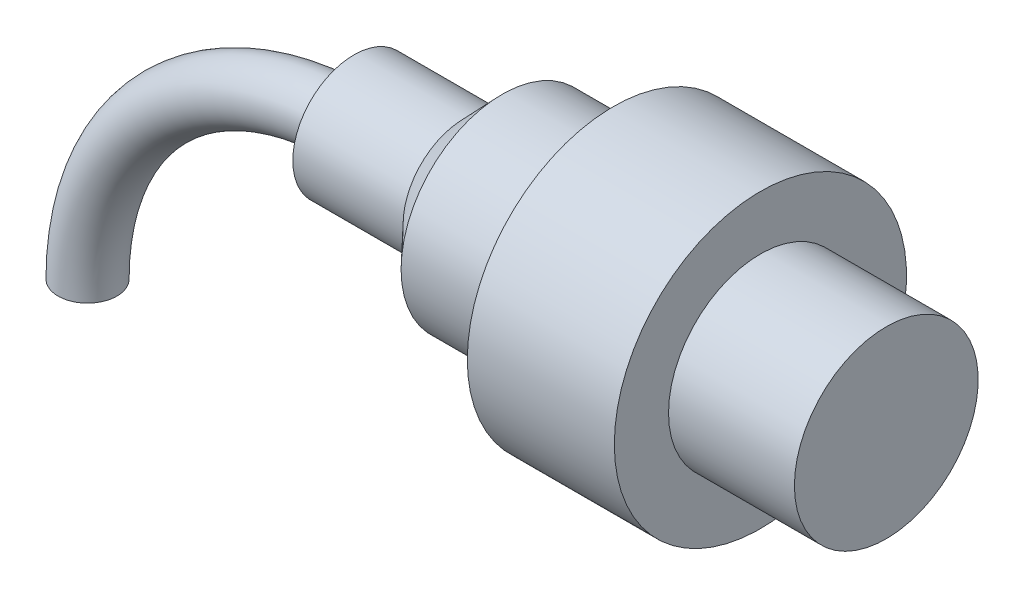
ISO-10303-21;
HEADER;
FILE_DESCRIPTION(('STEP AP214'),'2;1');
FILE_NAME('part.step','',(''),(''),'','','');
FILE_SCHEMA(('AUTOMOTIVE_DESIGN { 1 0 10303 214 1 1 1 1 }'));
ENDSEC;
DATA;
#1=APPLICATION_CONTEXT('core data for automotive mechanical design processes');
#2=APPLICATION_PROTOCOL_DEFINITION('international standard','automotive_design',2000,#1);
#3=PRODUCT_CONTEXT('',#1,'mechanical');
#4=PRODUCT('Part','Part','',(#3));
#5=PRODUCT_RELATED_PRODUCT_CATEGORY('part','',(#4));
#6=PRODUCT_DEFINITION_FORMATION('','',#4);
#7=PRODUCT_DEFINITION_CONTEXT('part definition',#1,'design');
#8=PRODUCT_DEFINITION('design','',#6,#7);
#9=PRODUCT_DEFINITION_SHAPE('','',#8);
#10=(LENGTH_UNIT() NAMED_UNIT(*) SI_UNIT(.MILLI.,.METRE.));
#11=(NAMED_UNIT(*) PLANE_ANGLE_UNIT() SI_UNIT($,.RADIAN.));
#12=(NAMED_UNIT(*) SI_UNIT($,.STERADIAN.) SOLID_ANGLE_UNIT());
#13=UNCERTAINTY_MEASURE_WITH_UNIT(LENGTH_MEASURE(1.E-05),#10,'distance_accuracy_value','');
#14=(GEOMETRIC_REPRESENTATION_CONTEXT(3) GLOBAL_UNCERTAINTY_ASSIGNED_CONTEXT((#13)) GLOBAL_UNIT_ASSIGNED_CONTEXT((#10,
#11,#12)) REPRESENTATION_CONTEXT('',''));
#15=CARTESIAN_POINT('',(0.,0.,0.));
#16=DIRECTION('',(0.,0.,1.));
#17=DIRECTION('',(1.,0.,0.));
#18=AXIS2_PLACEMENT_3D('',#15,#16,#17);
#19=CARTESIAN_POINT('',(28.9913780286485,0.,0.));
#20=DIRECTION('',(0.,0.,1.));
#21=DIRECTION('',(1.,0.,0.));
#22=AXIS2_PLACEMENT_3D('',#19,#20,#21);
#23=TOROIDAL_SURFACE('',#22,28.9913780286485,3.2);
#24=CARTESIAN_POINT('',(28.9913780286484,28.9913780286485,0.));
#25=DIRECTION('',(1.,0.,0.));
#26=DIRECTION('',(0.,0.,1.));
#27=AXIS2_PLACEMENT_3D('',#24,#25,#26);
#28=CIRCLE('',#27,3.2);
#29=CARTESIAN_POINT('',(28.9913780286484,32.1913780286485,0.));
#30=VERTEX_POINT('',#29);
#31=EDGE_CURVE('E10',#30,#30,#28,.T.);
#32=CARTESIAN_POINT('',(0.,0.,0.));
#33=DIRECTION('',(0.,1.,0.));
#34=DIRECTION('',(0.,0.,1.));
#35=AXIS2_PLACEMENT_3D('',#32,#33,#34);
#36=CIRCLE('',#35,3.2);
#37=CARTESIAN_POINT('',(-3.2,0.,0.));
#38=VERTEX_POINT('',#37);
#39=EDGE_CURVE('E41',#38,#38,#36,.T.);
#40=CARTESIAN_POINT('',(28.9913780286485,0.,0.));
#41=DIRECTION('',(0.,0.,1.));
#42=DIRECTION('',(1.,0.,0.));
#43=AXIS2_PLACEMENT_3D('',#40,#41,#42);
#44=CIRCLE('',#43,32.1913780286485);
#45=EDGE_CURVE('',#30,#38,#44,.T.);
#46=ORIENTED_EDGE('',*,*,#31,.F.);
#47=ORIENTED_EDGE('',*,*,#39,.T.);
#48=ORIENTED_EDGE('',*,*,#45,.T.);
#49=ORIENTED_EDGE('',*,*,#45,.F.);
#50=EDGE_LOOP('',(#46,#48,#47,#49));
#51=FACE_BOUND('',#50,.T.);
#52=ADVANCED_FACE('F35',(#51),#23,.T.);
#53=CARTESIAN_POINT('',(0.,0.,0.));
#54=DIRECTION('',(0.,1.,0.));
#55=DIRECTION('',(0.,0.,1.));
#56=AXIS2_PLACEMENT_3D('',#53,#54,#55);
#57=PLANE('',#56);
#58=ORIENTED_EDGE('',*,*,#39,.F.);
#59=EDGE_LOOP('',(#58));
#60=FACE_BOUND('',#59,.T.);
#61=ADVANCED_FACE('F91',(#60),#57,.F.);
#62=CARTESIAN_POINT('',(28.9913780286484,0.,0.));
#63=DIRECTION('',(-1.,0.,0.));
#64=DIRECTION('',(0.,0.,1.));
#65=AXIS2_PLACEMENT_3D('',#62,#63,#64);
#66=PLANE('',#65);
#67=CARTESIAN_POINT('',(28.9913780286484,28.9913780286484,0.));
#68=DIRECTION('',(-1.,0.,0.));
#69=DIRECTION('',(0.,0.,1.));
#70=AXIS2_PLACEMENT_3D('',#67,#68,#69);
#71=CIRCLE('',#70,6.65);
#72=CARTESIAN_POINT('',(28.9913780286484,28.9913780286484,6.65));
#73=VERTEX_POINT('',#72);
#74=EDGE_CURVE('E72',#73,#73,#71,.T.);
#75=ORIENTED_EDGE('',*,*,#74,.T.);
#76=EDGE_LOOP('',(#75));
#77=FACE_BOUND('',#76,.T.);
#78=ORIENTED_EDGE('',*,*,#31,.T.);
#79=EDGE_LOOP('',(#78));
#80=FACE_BOUND('',#79,.T.);
#81=ADVANCED_FACE('F76',(#77,#80),#66,.T.);
#82=CARTESIAN_POINT('',(86.9310019734058,0.,0.));
#83=DIRECTION('',(-1.,0.,0.));
#84=DIRECTION('',(0.,0.,1.));
#85=AXIS2_PLACEMENT_3D('',#82,#83,#84);
#86=PLANE('',#85);
#87=CARTESIAN_POINT('',(86.9310019734058,28.9913780286484,0.));
#88=DIRECTION('',(-1.,0.,0.));
#89=DIRECTION('',(0.,0.,1.));
#90=AXIS2_PLACEMENT_3D('',#87,#88,#89);
#91=CIRCLE('',#90,10.);
#92=CARTESIAN_POINT('',(86.9310019734058,28.9913780286484,10.));
#93=VERTEX_POINT('',#92);
#94=EDGE_CURVE('E45',#93,#93,#91,.T.);
#95=ORIENTED_EDGE('',*,*,#94,.F.);
#96=EDGE_LOOP('',(#95));
#97=FACE_BOUND('',#96,.T.);
#98=ADVANCED_FACE('F100',(#97),#86,.F.);
#99=CARTESIAN_POINT('',(28.9913780286484,28.9913780286484,0.));
#100=DIRECTION('',(-1.,0.,0.));
#101=DIRECTION('',(0.,0.,1.));
#102=AXIS2_PLACEMENT_3D('',#99,#100,#101);
#103=CYLINDRICAL_SURFACE('',#102,10.);
#104=ORIENTED_EDGE('',*,*,#94,.T.);
#105=EDGE_LOOP('',(#104));
#106=FACE_BOUND('',#105,.T.);
#107=CARTESIAN_POINT('',(73.2310019734058,28.9913780286484,0.));
#108=DIRECTION('',(-1.,0.,0.));
#109=DIRECTION('',(0.,0.,1.));
#110=AXIS2_PLACEMENT_3D('',#107,#108,#109);
#111=CIRCLE('',#110,10.);
#112=CARTESIAN_POINT('',(73.2310019734058,28.9913780286484,10.));
#113=VERTEX_POINT('',#112);
#114=EDGE_CURVE('E49',#113,#113,#111,.T.);
#115=ORIENTED_EDGE('',*,*,#114,.F.);
#116=EDGE_LOOP('',(#115));
#117=FACE_BOUND('',#116,.T.);
#118=ADVANCED_FACE('F104',(#106,#117),#103,.T.);
#119=CARTESIAN_POINT('',(73.2310019734058,0.,0.));
#120=DIRECTION('',(1.,0.,0.));
#121=DIRECTION('',(0.,0.,-1.));
#122=AXIS2_PLACEMENT_3D('',#119,#120,#121);
#123=PLANE('',#122);
#124=ORIENTED_EDGE('',*,*,#114,.T.);
#125=EDGE_LOOP('',(#124));
#126=FACE_BOUND('',#125,.T.);
#127=CARTESIAN_POINT('',(73.2310019734058,28.9913780286484,0.));
#128=DIRECTION('',(-1.,0.,0.));
#129=DIRECTION('',(0.,0.,1.));
#130=AXIS2_PLACEMENT_3D('',#127,#128,#129);
#131=CIRCLE('',#130,15.9);
#132=CARTESIAN_POINT('',(73.2310019734058,28.9913780286484,15.9));
#133=VERTEX_POINT('',#132);
#134=EDGE_CURVE('E54',#133,#133,#131,.T.);
#135=ORIENTED_EDGE('',*,*,#134,.F.);
#136=EDGE_LOOP('',(#135));
#137=FACE_BOUND('',#136,.T.);
#138=ADVANCED_FACE('F108',(#126,#137),#123,.T.);
#139=CARTESIAN_POINT('',(28.9913780286484,28.9913780286484,0.));
#140=DIRECTION('',(-1.,0.,0.));
#141=DIRECTION('',(0.,0.,1.));
#142=AXIS2_PLACEMENT_3D('',#139,#140,#141);
#143=CYLINDRICAL_SURFACE('',#142,15.9);
#144=ORIENTED_EDGE('',*,*,#134,.T.);
#145=EDGE_LOOP('',(#144));
#146=FACE_BOUND('',#145,.T.);
#147=CARTESIAN_POINT('',(57.2310019734058,28.9913780286484,0.));
#148=DIRECTION('',(-1.,0.,0.));
#149=DIRECTION('',(0.,0.,1.));
#150=AXIS2_PLACEMENT_3D('',#147,#148,#149);
#151=CIRCLE('',#150,15.9);
#152=CARTESIAN_POINT('',(57.2310019734058,28.9913780286484,15.9));
#153=VERTEX_POINT('',#152);
#154=EDGE_CURVE('E57',#153,#153,#151,.T.);
#155=ORIENTED_EDGE('',*,*,#154,.F.);
#156=EDGE_LOOP('',(#155));
#157=FACE_BOUND('',#156,.T.);
#158=ADVANCED_FACE('F112',(#146,#157),#143,.T.);
#159=CARTESIAN_POINT('',(57.2310019734058,0.,0.));
#160=DIRECTION('',(-1.,0.,0.));
#161=DIRECTION('',(0.,0.,1.));
#162=AXIS2_PLACEMENT_3D('',#159,#160,#161);
#163=PLANE('',#162);
#164=ORIENTED_EDGE('',*,*,#154,.T.);
#165=EDGE_LOOP('',(#164));
#166=FACE_BOUND('',#165,.T.);
#167=CARTESIAN_POINT('',(57.2310019734058,28.9913780286484,0.));
#168=DIRECTION('',(-1.,0.,0.));
#169=DIRECTION('',(0.,0.,1.));
#170=AXIS2_PLACEMENT_3D('',#167,#168,#169);
#171=CIRCLE('',#170,14.4);
#172=CARTESIAN_POINT('',(57.2310019734058,28.9913780286484,14.4));
#173=VERTEX_POINT('',#172);
#174=EDGE_CURVE('E60',#173,#173,#171,.T.);
#175=ORIENTED_EDGE('',*,*,#174,.F.);
#176=EDGE_LOOP('',(#175));
#177=FACE_BOUND('',#176,.T.);
#178=ADVANCED_FACE('F116',(#166,#177),#163,.T.);
#179=CARTESIAN_POINT('',(55.1238712228352,28.9913780286484,0.));
#180=DIRECTION('',(1.,0.,0.));
#181=DIRECTION('',(0.,0.,-1.));
#182=AXIS2_PLACEMENT_3D('',#179,#180,#181);
#183=CONICAL_SURFACE('',#182,11.,1.01598529381482);
#184=ORIENTED_EDGE('',*,*,#174,.T.);
#185=EDGE_LOOP('',(#184));
#186=FACE_BOUND('',#185,.T.);
#187=CARTESIAN_POINT('',(55.1238712228352,28.9913780286484,0.));
#188=DIRECTION('',(-1.,0.,0.));
#189=DIRECTION('',(0.,0.,1.));
#190=AXIS2_PLACEMENT_3D('',#187,#188,#189);
#191=CIRCLE('',#190,11.);
#192=CARTESIAN_POINT('',(55.1238712228352,28.9913780286484,11.));
#193=VERTEX_POINT('',#192);
#194=EDGE_CURVE('E63',#193,#193,#191,.T.);
#195=ORIENTED_EDGE('',*,*,#194,.F.);
#196=EDGE_LOOP('',(#195));
#197=FACE_BOUND('',#196,.T.);
#198=ADVANCED_FACE('F120',(#186,#197),#183,.T.);
#199=CARTESIAN_POINT('',(28.9913780286484,28.9913780286484,0.));
#200=DIRECTION('',(-1.,0.,0.));
#201=DIRECTION('',(0.,0.,1.));
#202=AXIS2_PLACEMENT_3D('',#199,#200,#201);
#203=CYLINDRICAL_SURFACE('',#202,11.);
#204=ORIENTED_EDGE('',*,*,#194,.T.);
#205=EDGE_LOOP('',(#204));
#206=FACE_BOUND('',#205,.T.);
#207=CARTESIAN_POINT('',(45.1238712228352,28.9913780286484,0.));
#208=DIRECTION('',(-1.,0.,0.));
#209=DIRECTION('',(0.,0.,1.));
#210=AXIS2_PLACEMENT_3D('',#207,#208,#209);
#211=CIRCLE('',#210,11.);
#212=CARTESIAN_POINT('',(45.1238712228352,28.9913780286484,11.));
#213=VERTEX_POINT('',#212);
#214=EDGE_CURVE('E66',#213,#213,#211,.T.);
#215=ORIENTED_EDGE('',*,*,#214,.F.);
#216=EDGE_LOOP('',(#215));
#217=FACE_BOUND('',#216,.T.);
#218=ADVANCED_FACE('F86',(#206,#217),#203,.T.);
#219=CARTESIAN_POINT('',(40.9913780286485,28.9913780286484,0.));
#220=DIRECTION('',(1.,0.,0.));
#221=DIRECTION('',(0.,0.,-1.));
#222=AXIS2_PLACEMENT_3D('',#219,#220,#221);
#223=CONICAL_SURFACE('',#222,6.65,0.811034394287584);
#224=ORIENTED_EDGE('',*,*,#214,.T.);
#225=EDGE_LOOP('',(#224));
#226=FACE_BOUND('',#225,.T.);
#227=CARTESIAN_POINT('',(40.9913780286485,28.9913780286484,0.));
#228=DIRECTION('',(-1.,0.,0.));
#229=DIRECTION('',(0.,0.,1.));
#230=AXIS2_PLACEMENT_3D('',#227,#228,#229);
#231=CIRCLE('',#230,6.65);
#232=CARTESIAN_POINT('',(40.9913780286485,28.9913780286484,6.65));
#233=VERTEX_POINT('',#232);
#234=EDGE_CURVE('E69',#233,#233,#231,.T.);
#235=ORIENTED_EDGE('',*,*,#234,.F.);
#236=EDGE_LOOP('',(#235));
#237=FACE_BOUND('',#236,.T.);
#238=ADVANCED_FACE('F80',(#226,#237),#223,.T.);
#239=CARTESIAN_POINT('',(28.9913780286484,28.9913780286484,0.));
#240=DIRECTION('',(-1.,0.,0.));
#241=DIRECTION('',(0.,0.,1.));
#242=AXIS2_PLACEMENT_3D('',#239,#240,#241);
#243=CYLINDRICAL_SURFACE('',#242,6.65);
#244=ORIENTED_EDGE('',*,*,#234,.T.);
#245=EDGE_LOOP('',(#244));
#246=FACE_BOUND('',#245,.T.);
#247=ORIENTED_EDGE('',*,*,#74,.F.);
#248=EDGE_LOOP('',(#247));
#249=FACE_BOUND('',#248,.T.);
#250=ADVANCED_FACE('F78',(#246,#249),#243,.T.);
#251=CLOSED_SHELL('',(#52,#61,#81,#98,#118,#138,#158,#178,#198,#218,#238,#250));
#252=MANIFOLD_SOLID_BREP('B2',#251);
#253=ADVANCED_BREP_SHAPE_REPRESENTATION('',(#18,#252),#14);
#254=SHAPE_DEFINITION_REPRESENTATION(#9,#253);
ENDSEC;
END-ISO-10303-21;
